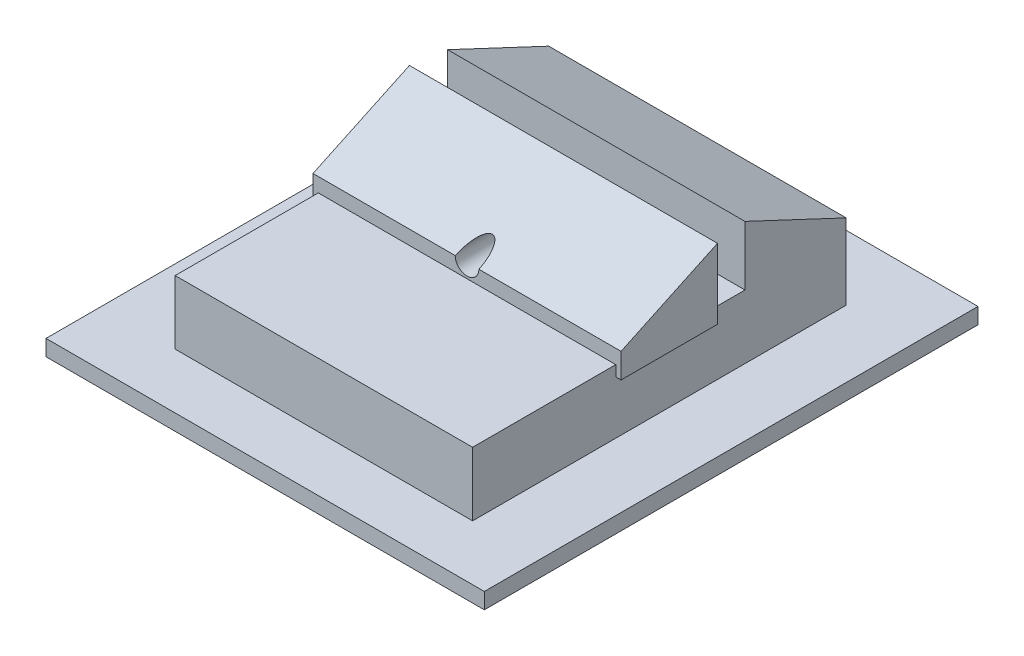
ISO-10303-21;
HEADER;
FILE_DESCRIPTION(('STEP AP214'),'2;1');
FILE_NAME('part.step','',(''),(''),'','','');
FILE_SCHEMA(('AUTOMOTIVE_DESIGN { 1 0 10303 214 1 1 1 1 }'));
ENDSEC;
DATA;
#1=APPLICATION_CONTEXT('core data for automotive mechanical design processes');
#2=APPLICATION_PROTOCOL_DEFINITION('international standard','automotive_design',2000,#1);
#3=PRODUCT_CONTEXT('',#1,'mechanical');
#4=PRODUCT('Part','Part','',(#3));
#5=PRODUCT_RELATED_PRODUCT_CATEGORY('part','',(#4));
#6=PRODUCT_DEFINITION_FORMATION('','',#4);
#7=PRODUCT_DEFINITION_CONTEXT('part definition',#1,'design');
#8=PRODUCT_DEFINITION('design','',#6,#7);
#9=PRODUCT_DEFINITION_SHAPE('','',#8);
#10=(LENGTH_UNIT() NAMED_UNIT(*) SI_UNIT(.MILLI.,.METRE.));
#11=(NAMED_UNIT(*) PLANE_ANGLE_UNIT() SI_UNIT($,.RADIAN.));
#12=(NAMED_UNIT(*) SI_UNIT($,.STERADIAN.) SOLID_ANGLE_UNIT());
#13=UNCERTAINTY_MEASURE_WITH_UNIT(LENGTH_MEASURE(1.E-05),#10,'distance_accuracy_value','');
#14=(GEOMETRIC_REPRESENTATION_CONTEXT(3) GLOBAL_UNCERTAINTY_ASSIGNED_CONTEXT((#13)) GLOBAL_UNIT_ASSIGNED_CONTEXT((#10,
#11,#12)) REPRESENTATION_CONTEXT('',''));
#15=CARTESIAN_POINT('',(0.,0.,0.));
#16=DIRECTION('',(0.,0.,1.));
#17=DIRECTION('',(1.,0.,0.));
#18=AXIS2_PLACEMENT_3D('',#15,#16,#17);
#19=CARTESIAN_POINT('',(25.,72.8506697779408,0.));
#20=DIRECTION('',(0.,1.,0.));
#21=DIRECTION('',(0.,0.,1.));
#22=AXIS2_PLACEMENT_3D('',#19,#20,#21);
#23=PLANE('',#22);
#24=DIRECTION('',(-1.,0.,0.));
#25=VECTOR('',#24,1.);
#26=CARTESIAN_POINT('',(25.,72.8506697779408,43.1120551741029));
#27=LINE('',#26,#25);
#28=CARTESIAN_POINT('',(26.5,72.8506697779408,43.1120551741029));
#29=VERTEX_POINT('',#28);
#30=CARTESIAN_POINT('',(-1.5,72.8506697779408,43.1120551741029));
#31=VERTEX_POINT('',#30);
#32=EDGE_CURVE('E59',#29,#31,#27,.T.);
#33=ORIENTED_EDGE('',*,*,#32,.T.);
#34=DIRECTION('',(0.,0.,-1.));
#35=VECTOR('',#34,1.);
#36=CARTESIAN_POINT('',(-1.5,72.8506697779408,33.5856982704937));
#37=LINE('',#36,#35);
#38=CARTESIAN_POINT('',(-1.5,72.8506697779408,46.2000152725175));
#39=VERTEX_POINT('',#38);
#40=EDGE_CURVE('E222',#39,#31,#37,.T.);
#41=ORIENTED_EDGE('',*,*,#40,.F.);
#42=DIRECTION('',(-1.,0.,0.));
#43=VECTOR('',#42,1.);
#44=CARTESIAN_POINT('',(25.,72.8506697779408,46.2000152725175));
#45=LINE('',#44,#43);
#46=CARTESIAN_POINT('',(26.5,72.8506697779408,46.2000152725175));
#47=VERTEX_POINT('',#46);
#48=EDGE_CURVE('E190',#47,#39,#45,.T.);
#49=ORIENTED_EDGE('',*,*,#48,.F.);
#50=DIRECTION('',(0.,0.,1.));
#51=VECTOR('',#50,1.);
#52=CARTESIAN_POINT('',(26.5,72.8506697779408,68.7550575810576));
#53=LINE('',#52,#51);
#54=EDGE_CURVE('E182',#29,#47,#53,.T.);
#55=ORIENTED_EDGE('',*,*,#54,.F.);
#56=EDGE_LOOP('',(#33,#41,#49,#55));
#57=FACE_BOUND('',#56,.T.);
#58=ADVANCED_FACE('F38',(#57),#23,.T.);
#59=CARTESIAN_POINT('',(-1.5,0.,0.));
#60=DIRECTION('',(1.,0.,0.));
#61=DIRECTION('',(0.,0.,-1.));
#62=AXIS2_PLACEMENT_3D('',#59,#60,#61);
#63=PLANE('',#62);
#64=DIRECTION('',(0.,1.,0.));
#65=VECTOR('',#64,1.);
#66=CARTESIAN_POINT('',(-1.5,0.,55.2786179618566));
#67=LINE('',#66,#65);
#68=CARTESIAN_POINT('',(-1.5,71.8506697779408,55.2786179618566));
#69=VERTEX_POINT('',#68);
#70=CARTESIAN_POINT('',(-1.5,72.8506697779408,55.2786179618566));
#71=VERTEX_POINT('',#70);
#72=EDGE_CURVE('E331',#69,#71,#67,.T.);
#73=ORIENTED_EDGE('',*,*,#72,.F.);
#74=DIRECTION('',(0.,0.,1.));
#75=VECTOR('',#74,1.);
#76=CARTESIAN_POINT('',(-1.5,71.8506697779408,0.));
#77=LINE('',#76,#75);
#78=CARTESIAN_POINT('',(-1.5,71.8506697779408,46.2000152725175));
#79=VERTEX_POINT('',#78);
#80=EDGE_CURVE('E333',#79,#69,#77,.T.);
#81=ORIENTED_EDGE('',*,*,#80,.F.);
#82=DIRECTION('',(0.,-1.,0.));
#83=VECTOR('',#82,1.);
#84=CARTESIAN_POINT('',(-1.5,0.,46.2000152725175));
#85=LINE('',#84,#83);
#86=EDGE_CURVE('E217',#39,#79,#85,.T.);
#87=ORIENTED_EDGE('',*,*,#86,.F.);
#88=ORIENTED_EDGE('',*,*,#40,.T.);
#89=DIRECTION('',(0.,1.,0.));
#90=VECTOR('',#89,1.);
#91=CARTESIAN_POINT('',(-1.5,72.8506697779408,43.1120551741029));
#92=LINE('',#91,#90);
#93=CARTESIAN_POINT('',(-1.5,78.4444528632995,43.1120551741029));
#94=VERTEX_POINT('',#93);
#95=EDGE_CURVE('E345',#31,#94,#92,.T.);
#96=ORIENTED_EDGE('',*,*,#95,.T.);
#97=DIRECTION('',(0.,-0.425308365150564,-0.905048503967027));
#98=VECTOR('',#97,1.);
#99=CARTESIAN_POINT('',(-1.5,78.4444528632995,43.1120551741029));
#100=LINE('',#99,#98);
#101=CARTESIAN_POINT('',(-1.5,73.9677433137499,33.5856982704937));
#102=VERTEX_POINT('',#101);
#103=EDGE_CURVE('E343',#94,#102,#100,.T.);
#104=ORIENTED_EDGE('',*,*,#103,.T.);
#105=DIRECTION('',(0.,-1.,0.));
#106=VECTOR('',#105,1.);
#107=CARTESIAN_POINT('',(-1.5,66.8506697779408,33.5856982704937));
#108=LINE('',#107,#106);
#109=CARTESIAN_POINT('',(-1.5,66.8506697779408,33.5856982704937));
#110=VERTEX_POINT('',#109);
#111=EDGE_CURVE('E267',#102,#110,#108,.T.);
#112=ORIENTED_EDGE('',*,*,#111,.T.);
#113=DIRECTION('',(0.,0.,1.));
#114=VECTOR('',#113,1.);
#115=CARTESIAN_POINT('',(-1.5,66.8506697779408,33.5856982704937));
#116=LINE('',#115,#114);
#117=CARTESIAN_POINT('',(-1.5,66.8506697779408,68.7550575810576));
#118=VERTEX_POINT('',#117);
#119=EDGE_CURVE('E232',#110,#118,#116,.T.);
#120=ORIENTED_EDGE('',*,*,#119,.T.);
#121=DIRECTION('',(0.,1.,0.));
#122=VECTOR('',#121,1.);
#123=CARTESIAN_POINT('',(-1.5,66.8506697779408,68.7550575810576));
#124=LINE('',#123,#122);
#125=CARTESIAN_POINT('',(-1.5,72.8506697779408,68.7550575810576));
#126=VERTEX_POINT('',#125);
#127=EDGE_CURVE('E227',#118,#126,#124,.T.);
#128=ORIENTED_EDGE('',*,*,#127,.T.);
#129=EDGE_CURVE('E226',#126,#71,#37,.T.);
#130=ORIENTED_EDGE('',*,*,#129,.T.);
#131=EDGE_LOOP('',(#73,#81,#87,#88,#96,#104,#112,#120,#128,#130));
#132=FACE_BOUND('',#131,.T.);
#133=ADVANCED_FACE('F265',(#132),#63,.F.);
#134=CARTESIAN_POINT('',(26.5,0.,0.));
#135=DIRECTION('',(1.,0.,0.));
#136=DIRECTION('',(0.,0.,-1.));
#137=AXIS2_PLACEMENT_3D('',#134,#135,#136);
#138=PLANE('',#137);
#139=DIRECTION('',(0.,0.,-1.));
#140=VECTOR('',#139,1.);
#141=CARTESIAN_POINT('',(26.5,71.8506697779408,55.2786179618566));
#142=LINE('',#141,#140);
#143=CARTESIAN_POINT('',(26.5,71.8506697779408,55.2786179618566));
#144=VERTEX_POINT('',#143);
#145=CARTESIAN_POINT('',(26.5,71.8506697779408,46.2000152725175));
#146=VERTEX_POINT('',#145);
#147=EDGE_CURVE('E320',#144,#146,#142,.T.);
#148=ORIENTED_EDGE('',*,*,#147,.F.);
#149=DIRECTION('',(0.,-1.,0.));
#150=VECTOR('',#149,1.);
#151=CARTESIAN_POINT('',(26.5,72.8506697779408,55.2786179618566));
#152=LINE('',#151,#150);
#153=CARTESIAN_POINT('',(26.5,72.8506697779408,55.2786179618566));
#154=VERTEX_POINT('',#153);
#155=EDGE_CURVE('E250',#154,#144,#152,.T.);
#156=ORIENTED_EDGE('',*,*,#155,.F.);
#157=CARTESIAN_POINT('',(26.5,72.8506697779408,68.7550575810576));
#158=VERTEX_POINT('',#157);
#159=EDGE_CURVE('E185',#154,#158,#53,.T.);
#160=ORIENTED_EDGE('',*,*,#159,.T.);
#161=DIRECTION('',(0.,-1.,0.));
#162=VECTOR('',#161,1.);
#163=CARTESIAN_POINT('',(26.5,72.8506697779408,68.7550575810576));
#164=LINE('',#163,#162);
#165=CARTESIAN_POINT('',(26.5,66.8506697779408,68.7550575810576));
#166=VERTEX_POINT('',#165);
#167=EDGE_CURVE('E230',#158,#166,#164,.T.);
#168=ORIENTED_EDGE('',*,*,#167,.T.);
#169=DIRECTION('',(0.,0.,-1.));
#170=VECTOR('',#169,1.);
#171=CARTESIAN_POINT('',(26.5,66.8506697779408,68.7550575810576));
#172=LINE('',#171,#170);
#173=CARTESIAN_POINT('',(26.5,66.8506697779408,33.5856982704937));
#174=VERTEX_POINT('',#173);
#175=EDGE_CURVE('E238',#166,#174,#172,.T.);
#176=ORIENTED_EDGE('',*,*,#175,.T.);
#177=DIRECTION('',(0.,1.,0.));
#178=VECTOR('',#177,1.);
#179=CARTESIAN_POINT('',(26.5,72.8506697779408,33.5856982704937));
#180=LINE('',#179,#178);
#181=CARTESIAN_POINT('',(26.5,73.9677433137499,33.5856982704937));
#182=VERTEX_POINT('',#181);
#183=EDGE_CURVE('E240',#174,#182,#180,.T.);
#184=ORIENTED_EDGE('',*,*,#183,.T.);
#185=DIRECTION('',(0.,0.425308365150564,0.905048503967027));
#186=VECTOR('',#185,1.);
#187=CARTESIAN_POINT('',(26.5,73.9677433137499,33.5856982704937));
#188=LINE('',#187,#186);
#189=CARTESIAN_POINT('',(26.5,78.4444528632995,43.1120551741029));
#190=VERTEX_POINT('',#189);
#191=EDGE_CURVE('E336',#182,#190,#188,.T.);
#192=ORIENTED_EDGE('',*,*,#191,.T.);
#193=DIRECTION('',(0.,-1.,0.));
#194=VECTOR('',#193,1.);
#195=CARTESIAN_POINT('',(26.5,78.4444528632995,43.1120551741029));
#196=LINE('',#195,#194);
#197=EDGE_CURVE('E340',#190,#29,#196,.T.);
#198=ORIENTED_EDGE('',*,*,#197,.T.);
#199=ORIENTED_EDGE('',*,*,#54,.T.);
#200=DIRECTION('',(0.,1.,0.));
#201=VECTOR('',#200,1.);
#202=CARTESIAN_POINT('',(26.5,71.8506697779408,46.2000152725175));
#203=LINE('',#202,#201);
#204=EDGE_CURVE('E221',#146,#47,#203,.T.);
#205=ORIENTED_EDGE('',*,*,#204,.F.);
#206=EDGE_LOOP('',(#148,#156,#160,#168,#176,#184,#192,#198,#199,#205));
#207=FACE_BOUND('',#206,.T.);
#208=ADVANCED_FACE('F248',(#207),#138,.T.);
#209=DIRECTION('',(-1.,0.,0.));
#210=VECTOR('',#209,1.);
#211=CARTESIAN_POINT('',(25.,72.8506697779408,55.2786179618566));
#212=LINE('',#211,#210);
#213=EDGE_CURVE('E46',#154,#71,#212,.T.);
#214=ORIENTED_EDGE('',*,*,#213,.T.);
#215=ORIENTED_EDGE('',*,*,#129,.F.);
#216=DIRECTION('',(-1.,0.,0.));
#217=VECTOR('',#216,1.);
#218=CARTESIAN_POINT('',(25.,72.8506697779408,68.7550575810576));
#219=LINE('',#218,#217);
#220=EDGE_CURVE('E201',#158,#126,#219,.T.);
#221=ORIENTED_EDGE('',*,*,#220,.F.);
#222=ORIENTED_EDGE('',*,*,#159,.F.);
#223=EDGE_LOOP('',(#214,#215,#221,#222));
#224=FACE_BOUND('',#223,.T.);
#225=ADVANCED_FACE('F254',(#224),#23,.T.);
#226=CARTESIAN_POINT('',(25.,0.,55.2786179618566));
#227=DIRECTION('',(0.,0.,1.));
#228=DIRECTION('',(1.,0.,0.));
#229=AXIS2_PLACEMENT_3D('',#226,#227,#228);
#230=PLANE('',#229);
#231=CARTESIAN_POINT('',(12.5,74.1848405548437,55.2786179618566));
#232=DIRECTION('',(0.,0.,1.));
#233=DIRECTION('',(1.,0.,0.));
#234=AXIS2_PLACEMENT_3D('',#231,#232,#233);
#235=CIRCLE('',#234,1.11444040134291);
#236=CARTESIAN_POINT('',(11.3855595986571,74.1848405548437,55.2786179618566));
#237=VERTEX_POINT('',#236);
#238=CARTESIAN_POINT('',(13.6144404013429,74.1848405548437,55.2786179618566));
#239=VERTEX_POINT('',#238);
#240=EDGE_CURVE('E52',#237,#239,#235,.T.);
#241=ORIENTED_EDGE('',*,*,#240,.F.);
#242=DIRECTION('',(-1.,0.,0.));
#243=VECTOR('',#242,1.);
#244=CARTESIAN_POINT('',(25.,74.1848405548437,55.2786179618566));
#245=LINE('',#244,#243);
#246=CARTESIAN_POINT('',(-2.,74.1848405548437,55.2786179618566));
#247=VERTEX_POINT('',#246);
#248=EDGE_CURVE('E172',#237,#247,#245,.T.);
#249=ORIENTED_EDGE('',*,*,#248,.T.);
#250=DIRECTION('',(0.,1.,0.));
#251=VECTOR('',#250,1.);
#252=CARTESIAN_POINT('',(-2.,72.8506697779408,55.2786179618566));
#253=LINE('',#252,#251);
#254=CARTESIAN_POINT('',(-2.,71.8506697779408,55.2786179618566));
#255=VERTEX_POINT('',#254);
#256=EDGE_CURVE('E309',#255,#247,#253,.T.);
#257=ORIENTED_EDGE('',*,*,#256,.F.);
#258=DIRECTION('',(1.,0.,0.));
#259=VECTOR('',#258,1.);
#260=CARTESIAN_POINT('',(-2.,71.8506697779408,55.2786179618566));
#261=LINE('',#260,#259);
#262=EDGE_CURVE('E323',#255,#69,#261,.T.);
#263=ORIENTED_EDGE('',*,*,#262,.T.);
#264=ORIENTED_EDGE('',*,*,#72,.T.);
#265=ORIENTED_EDGE('',*,*,#213,.F.);
#266=ORIENTED_EDGE('',*,*,#155,.T.);
#267=DIRECTION('',(-1.,0.,0.));
#268=VECTOR('',#267,1.);
#269=CARTESIAN_POINT('',(27.,71.8506697779408,55.2786179618566));
#270=LINE('',#269,#268);
#271=CARTESIAN_POINT('',(27.,71.8506697779408,55.2786179618566));
#272=VERTEX_POINT('',#271);
#273=EDGE_CURVE('E313',#272,#144,#270,.T.);
#274=ORIENTED_EDGE('',*,*,#273,.F.);
#275=DIRECTION('',(0.,-1.,0.));
#276=VECTOR('',#275,1.);
#277=CARTESIAN_POINT('',(27.,72.8506697779408,55.2786179618566));
#278=LINE('',#277,#276);
#279=CARTESIAN_POINT('',(27.,74.1848405548437,55.2786179618566));
#280=VERTEX_POINT('',#279);
#281=EDGE_CURVE('E293',#280,#272,#278,.T.);
#282=ORIENTED_EDGE('',*,*,#281,.F.);
#283=EDGE_CURVE('E175',#280,#239,#245,.T.);
#284=ORIENTED_EDGE('',*,*,#283,.T.);
#285=EDGE_LOOP('',(#241,#249,#257,#263,#264,#265,#266,#274,#282,#284));
#286=FACE_BOUND('',#285,.T.);
#287=ADVANCED_FACE('F40',(#286),#230,.T.);
#288=CARTESIAN_POINT('',(25.,0.,68.7550575810576));
#289=DIRECTION('',(0.,0.,-1.));
#290=DIRECTION('',(-1.,0.,0.));
#291=AXIS2_PLACEMENT_3D('',#288,#289,#290);
#292=PLANE('',#291);
#293=ORIENTED_EDGE('',*,*,#220,.T.);
#294=ORIENTED_EDGE('',*,*,#127,.F.);
#295=DIRECTION('',(-1.,0.,0.));
#296=VECTOR('',#295,1.);
#297=CARTESIAN_POINT('',(25.,66.8506697779408,68.7550575810576));
#298=LINE('',#297,#296);
#299=EDGE_CURVE('E199',#166,#118,#298,.T.);
#300=ORIENTED_EDGE('',*,*,#299,.F.);
#301=ORIENTED_EDGE('',*,*,#167,.F.);
#302=EDGE_LOOP('',(#293,#294,#300,#301));
#303=FACE_BOUND('',#302,.T.);
#304=ADVANCED_FACE('F258',(#303),#292,.F.);
#305=CARTESIAN_POINT('',(25.,0.,33.5856982704937));
#306=DIRECTION('',(0.,0.,-1.));
#307=DIRECTION('',(-1.,0.,0.));
#308=AXIS2_PLACEMENT_3D('',#305,#306,#307);
#309=PLANE('',#308);
#310=ORIENTED_EDGE('',*,*,#111,.F.);
#311=DIRECTION('',(-1.,0.,0.));
#312=VECTOR('',#311,1.);
#313=CARTESIAN_POINT('',(25.,73.9677433137499,33.5856982704937));
#314=LINE('',#313,#312);
#315=EDGE_CURVE('E193',#182,#102,#314,.T.);
#316=ORIENTED_EDGE('',*,*,#315,.F.);
#317=ORIENTED_EDGE('',*,*,#183,.F.);
#318=DIRECTION('',(-1.,0.,0.));
#319=VECTOR('',#318,1.);
#320=CARTESIAN_POINT('',(25.,66.8506697779408,33.5856982704937));
#321=LINE('',#320,#319);
#322=EDGE_CURVE('E196',#174,#110,#321,.T.);
#323=ORIENTED_EDGE('',*,*,#322,.T.);
#324=EDGE_LOOP('',(#310,#316,#317,#323));
#325=FACE_BOUND('',#324,.T.);
#326=ADVANCED_FACE('F389',(#325),#309,.T.);
#327=CARTESIAN_POINT('',(25.,47.6599601132555,-22.3967882716353));
#328=DIRECTION('',(0.,0.905048503967027,-0.425308365150564));
#329=DIRECTION('',(0.,0.425308365150565,0.905048503967027));
#330=AXIS2_PLACEMENT_3D('',#327,#328,#329);
#331=PLANE('',#330);
#332=ORIENTED_EDGE('',*,*,#315,.T.);
#333=ORIENTED_EDGE('',*,*,#103,.F.);
#334=DIRECTION('',(-1.,0.,0.));
#335=VECTOR('',#334,1.);
#336=CARTESIAN_POINT('',(25.,78.4444528632995,43.1120551741029));
#337=LINE('',#336,#335);
#338=EDGE_CURVE('E191',#190,#94,#337,.T.);
#339=ORIENTED_EDGE('',*,*,#338,.F.);
#340=ORIENTED_EDGE('',*,*,#191,.F.);
#341=EDGE_LOOP('',(#332,#333,#339,#340));
#342=FACE_BOUND('',#341,.T.);
#343=ADVANCED_FACE('F384',(#342),#331,.T.);
#344=CARTESIAN_POINT('',(25.,0.,43.1120551741029));
#345=DIRECTION('',(0.,0.,1.));
#346=DIRECTION('',(1.,0.,0.));
#347=AXIS2_PLACEMENT_3D('',#344,#345,#346);
#348=PLANE('',#347);
#349=ORIENTED_EDGE('',*,*,#338,.T.);
#350=ORIENTED_EDGE('',*,*,#95,.F.);
#351=ORIENTED_EDGE('',*,*,#32,.F.);
#352=ORIENTED_EDGE('',*,*,#197,.F.);
#353=EDGE_LOOP('',(#349,#350,#351,#352));
#354=FACE_BOUND('',#353,.T.);
#355=ADVANCED_FACE('F380',(#354),#348,.T.);
#356=CARTESIAN_POINT('',(25.,0.,46.2000152725175));
#357=DIRECTION('',(0.,0.,1.));
#358=DIRECTION('',(1.,0.,0.));
#359=AXIS2_PLACEMENT_3D('',#356,#357,#358);
#360=PLANE('',#359);
#361=CARTESIAN_POINT('',(12.5,74.1848405548437,46.2000152725175));
#362=DIRECTION('',(0.,0.,1.));
#363=DIRECTION('',(1.,0.,0.));
#364=AXIS2_PLACEMENT_3D('',#361,#362,#363);
#365=CIRCLE('',#364,1.11444040134291);
#366=CARTESIAN_POINT('',(13.6144404013429,74.1848405548437,46.2000152725175));
#367=VERTEX_POINT('',#366);
#368=EDGE_CURVE('E176',#367,#367,#365,.T.);
#369=ORIENTED_EDGE('',*,*,#368,.T.);
#370=EDGE_LOOP('',(#369));
#371=FACE_BOUND('',#370,.T.);
#372=ORIENTED_EDGE('',*,*,#48,.T.);
#373=ORIENTED_EDGE('',*,*,#86,.T.);
#374=DIRECTION('',(1.,0.,0.));
#375=VECTOR('',#374,1.);
#376=CARTESIAN_POINT('',(-2.,71.8506697779408,46.2000152725175));
#377=LINE('',#376,#375);
#378=CARTESIAN_POINT('',(-2.,71.8506697779408,46.2000152725175));
#379=VERTEX_POINT('',#378);
#380=EDGE_CURVE('E327',#379,#79,#377,.T.);
#381=ORIENTED_EDGE('',*,*,#380,.F.);
#382=DIRECTION('',(0.,-1.,0.));
#383=VECTOR('',#382,1.);
#384=CARTESIAN_POINT('',(-2.,78.4511374999575,46.2000152725175));
#385=LINE('',#384,#383);
#386=CARTESIAN_POINT('',(-2.,78.4511374999575,46.2000152725175));
#387=VERTEX_POINT('',#386);
#388=EDGE_CURVE('E311',#387,#379,#385,.T.);
#389=ORIENTED_EDGE('',*,*,#388,.F.);
#390=DIRECTION('',(-1.,0.,0.));
#391=VECTOR('',#390,1.);
#392=CARTESIAN_POINT('',(25.,78.4511374999575,46.2000152725175));
#393=LINE('',#392,#391);
#394=CARTESIAN_POINT('',(27.,78.4511374999575,46.2000152725175));
#395=VERTEX_POINT('',#394);
#396=EDGE_CURVE('E184',#395,#387,#393,.T.);
#397=ORIENTED_EDGE('',*,*,#396,.F.);
#398=DIRECTION('',(0.,1.,0.));
#399=VECTOR('',#398,1.);
#400=CARTESIAN_POINT('',(27.,78.4511374999575,46.2000152725175));
#401=LINE('',#400,#399);
#402=CARTESIAN_POINT('',(27.,71.8506697779408,46.2000152725175));
#403=VERTEX_POINT('',#402);
#404=EDGE_CURVE('E305',#403,#395,#401,.T.);
#405=ORIENTED_EDGE('',*,*,#404,.F.);
#406=DIRECTION('',(-1.,0.,0.));
#407=VECTOR('',#406,1.);
#408=CARTESIAN_POINT('',(27.,71.8506697779408,46.2000152725175));
#409=LINE('',#408,#407);
#410=EDGE_CURVE('E316',#403,#146,#409,.T.);
#411=ORIENTED_EDGE('',*,*,#410,.T.);
#412=ORIENTED_EDGE('',*,*,#204,.T.);
#413=EDGE_LOOP('',(#372,#373,#381,#389,#397,#405,#411,#412));
#414=FACE_BOUND('',#413,.T.);
#415=ADVANCED_FACE('F215',(#371,#414),#360,.F.);
#416=CARTESIAN_POINT('',(25.,82.0438574723616,38.5547721909579));
#417=DIRECTION('',(0.,-0.905048503967027,-0.425308365150564));
#418=DIRECTION('',(0.,0.425308365150565,-0.905048503967027));
#419=AXIS2_PLACEMENT_3D('',#416,#417,#418);
#420=PLANE('',#419);
#421=ORIENTED_EDGE('',*,*,#248,.F.);
#422=CARTESIAN_POINT('',(12.5,74.1848405548437,55.2786179618566));
#423=DIRECTION('',(0.,-0.905048503967027,-0.425308365150564));
#424=DIRECTION('',(0.,-0.425308365150564,0.905048503967027));
#425=AXIS2_PLACEMENT_3D('',#422,#423,#424);
#426=ELLIPSE('',#425,2.62031150256917,1.11444040134291);
#427=EDGE_CURVE('E11',#237,#239,#426,.T.);
#428=ORIENTED_EDGE('',*,*,#427,.T.);
#429=ORIENTED_EDGE('',*,*,#283,.F.);
#430=DIRECTION('',(0.,-0.425308365150563,0.905048503967028));
#431=VECTOR('',#430,1.);
#432=CARTESIAN_POINT('',(27.,74.1848405548437,55.2786179618566));
#433=LINE('',#432,#431);
#434=EDGE_CURVE('E302',#395,#280,#433,.T.);
#435=ORIENTED_EDGE('',*,*,#434,.F.);
#436=ORIENTED_EDGE('',*,*,#396,.T.);
#437=DIRECTION('',(0.,0.425308365150563,-0.905048503967028));
#438=VECTOR('',#437,1.);
#439=CARTESIAN_POINT('',(-2.,74.1848405548437,55.2786179618566));
#440=LINE('',#439,#438);
#441=EDGE_CURVE('E181',#247,#387,#440,.T.);
#442=ORIENTED_EDGE('',*,*,#441,.F.);
#443=EDGE_LOOP('',(#421,#428,#429,#435,#436,#442));
#444=FACE_BOUND('',#443,.T.);
#445=ADVANCED_FACE('F179',(#444),#420,.F.);
#446=CARTESIAN_POINT('',(-8.45650709040854,65.3506697779408,73.9567160795278));
#447=DIRECTION('',(1.,0.,0.));
#448=DIRECTION('',(0.,0.,-1.));
#449=AXIS2_PLACEMENT_3D('',#446,#447,#448);
#450=PLANE('',#449);
#451=DIRECTION('',(0.,0.,-1.));
#452=VECTOR('',#451,1.);
#453=CARTESIAN_POINT('',(-8.45650709040854,66.8506697779408,73.9567160795278));
#454=LINE('',#453,#452);
#455=CARTESIAN_POINT('',(-8.45650709040854,66.8506697779408,73.9567160795278));
#456=VERTEX_POINT('',#455);
#457=CARTESIAN_POINT('',(-8.45650709040854,66.8506697779408,27.4835577366269));
#458=VERTEX_POINT('',#457);
#459=EDGE_CURVE('E290',#456,#458,#454,.T.);
#460=ORIENTED_EDGE('',*,*,#459,.T.);
#461=DIRECTION('',(0.,1.,0.));
#462=VECTOR('',#461,1.);
#463=CARTESIAN_POINT('',(-8.45650709040854,65.3506697779408,27.4835577366269));
#464=LINE('',#463,#462);
#465=CARTESIAN_POINT('',(-8.45650709040854,65.3506697779408,27.4835577366269));
#466=VERTEX_POINT('',#465);
#467=EDGE_CURVE('E268',#466,#458,#464,.T.);
#468=ORIENTED_EDGE('',*,*,#467,.F.);
#469=DIRECTION('',(0.,0.,-1.));
#470=VECTOR('',#469,1.);
#471=CARTESIAN_POINT('',(-8.45650709040854,65.3506697779408,73.9567160795278));
#472=LINE('',#471,#470);
#473=CARTESIAN_POINT('',(-8.45650709040854,65.3506697779408,73.9567160795278));
#474=VERTEX_POINT('',#473);
#475=EDGE_CURVE('E285',#474,#466,#472,.T.);
#476=ORIENTED_EDGE('',*,*,#475,.F.);
#477=DIRECTION('',(0.,1.,0.));
#478=VECTOR('',#477,1.);
#479=CARTESIAN_POINT('',(-8.45650709040854,65.3506697779408,73.9567160795278));
#480=LINE('',#479,#478);
#481=EDGE_CURVE('E279',#474,#456,#480,.T.);
#482=ORIENTED_EDGE('',*,*,#481,.T.);
#483=EDGE_LOOP('',(#460,#468,#476,#482));
#484=FACE_BOUND('',#483,.T.);
#485=ADVANCED_FACE('F378',(#484),#450,.F.);
#486=CARTESIAN_POINT('',(-8.45650709040854,65.3506697779408,27.4835577366269));
#487=DIRECTION('',(0.,0.,1.));
#488=DIRECTION('',(1.,0.,0.));
#489=AXIS2_PLACEMENT_3D('',#486,#487,#488);
#490=PLANE('',#489);
#491=DIRECTION('',(1.,0.,0.));
#492=VECTOR('',#491,1.);
#493=CARTESIAN_POINT('',(-8.45650709040854,66.8506697779408,27.4835577366269));
#494=LINE('',#493,#492);
#495=CARTESIAN_POINT('',(32.8060244079853,66.8506697779408,27.4835577366269));
#496=VERTEX_POINT('',#495);
#497=EDGE_CURVE('E288',#458,#496,#494,.T.);
#498=ORIENTED_EDGE('',*,*,#497,.T.);
#499=DIRECTION('',(0.,1.,0.));
#500=VECTOR('',#499,1.);
#501=CARTESIAN_POINT('',(32.8060244079853,65.3506697779408,27.4835577366269));
#502=LINE('',#501,#500);
#503=CARTESIAN_POINT('',(32.8060244079853,65.3506697779408,27.4835577366269));
#504=VERTEX_POINT('',#503);
#505=EDGE_CURVE('E273',#504,#496,#502,.T.);
#506=ORIENTED_EDGE('',*,*,#505,.F.);
#507=DIRECTION('',(1.,0.,0.));
#508=VECTOR('',#507,1.);
#509=CARTESIAN_POINT('',(-8.45650709040854,65.3506697779408,27.4835577366269));
#510=LINE('',#509,#508);
#511=EDGE_CURVE('E297',#466,#504,#510,.T.);
#512=ORIENTED_EDGE('',*,*,#511,.F.);
#513=ORIENTED_EDGE('',*,*,#467,.T.);
#514=EDGE_LOOP('',(#498,#506,#512,#513));
#515=FACE_BOUND('',#514,.T.);
#516=ADVANCED_FACE('F448',(#515),#490,.F.);
#517=CARTESIAN_POINT('',(32.8060244079853,65.3506697779408,73.9567160795278));
#518=DIRECTION('',(-1.,0.,0.));
#519=DIRECTION('',(0.,0.,1.));
#520=AXIS2_PLACEMENT_3D('',#517,#518,#519);
#521=PLANE('',#520);
#522=DIRECTION('',(0.,0.,1.));
#523=VECTOR('',#522,1.);
#524=CARTESIAN_POINT('',(32.8060244079853,66.8506697779408,73.9567160795278));
#525=LINE('',#524,#523);
#526=CARTESIAN_POINT('',(32.8060244079853,66.8506697779408,73.9567160795278));
#527=VERTEX_POINT('',#526);
#528=EDGE_CURVE('E286',#496,#527,#525,.T.);
#529=ORIENTED_EDGE('',*,*,#528,.T.);
#530=DIRECTION('',(0.,1.,0.));
#531=VECTOR('',#530,1.);
#532=CARTESIAN_POINT('',(32.8060244079853,65.3506697779408,73.9567160795278));
#533=LINE('',#532,#531);
#534=CARTESIAN_POINT('',(32.8060244079853,65.3506697779408,73.9567160795278));
#535=VERTEX_POINT('',#534);
#536=EDGE_CURVE('E276',#535,#527,#533,.T.);
#537=ORIENTED_EDGE('',*,*,#536,.F.);
#538=DIRECTION('',(0.,0.,1.));
#539=VECTOR('',#538,1.);
#540=CARTESIAN_POINT('',(32.8060244079853,65.3506697779408,73.9567160795278));
#541=LINE('',#540,#539);
#542=EDGE_CURVE('E295',#504,#535,#541,.T.);
#543=ORIENTED_EDGE('',*,*,#542,.F.);
#544=ORIENTED_EDGE('',*,*,#505,.T.);
#545=EDGE_LOOP('',(#529,#537,#543,#544));
#546=FACE_BOUND('',#545,.T.);
#547=ADVANCED_FACE('F455',(#546),#521,.F.);
#548=CARTESIAN_POINT('',(-8.45650709040854,65.3506697779408,73.9567160795278));
#549=DIRECTION('',(0.,0.,-1.));
#550=DIRECTION('',(-1.,0.,0.));
#551=AXIS2_PLACEMENT_3D('',#548,#549,#550);
#552=PLANE('',#551);
#553=DIRECTION('',(-1.,0.,0.));
#554=VECTOR('',#553,1.);
#555=CARTESIAN_POINT('',(-8.45650709040854,66.8506697779408,73.9567160795278));
#556=LINE('',#555,#554);
#557=EDGE_CURVE('E283',#527,#456,#556,.T.);
#558=ORIENTED_EDGE('',*,*,#557,.T.);
#559=ORIENTED_EDGE('',*,*,#481,.F.);
#560=DIRECTION('',(-1.,0.,0.));
#561=VECTOR('',#560,1.);
#562=CARTESIAN_POINT('',(-8.45650709040854,65.3506697779408,73.9567160795278));
#563=LINE('',#562,#561);
#564=EDGE_CURVE('E282',#535,#474,#563,.T.);
#565=ORIENTED_EDGE('',*,*,#564,.F.);
#566=ORIENTED_EDGE('',*,*,#536,.T.);
#567=EDGE_LOOP('',(#558,#559,#565,#566));
#568=FACE_BOUND('',#567,.T.);
#569=ADVANCED_FACE('F463',(#568),#552,.F.);
#570=CARTESIAN_POINT('',(0.,65.3506697779408,0.));
#571=DIRECTION('',(0.,-1.,0.));
#572=DIRECTION('',(0.,0.,-1.));
#573=AXIS2_PLACEMENT_3D('',#570,#571,#572);
#574=PLANE('',#573);
#575=ORIENTED_EDGE('',*,*,#475,.T.);
#576=ORIENTED_EDGE('',*,*,#511,.T.);
#577=ORIENTED_EDGE('',*,*,#542,.T.);
#578=ORIENTED_EDGE('',*,*,#564,.T.);
#579=EDGE_LOOP('',(#575,#576,#577,#578));
#580=FACE_BOUND('',#579,.T.);
#581=ADVANCED_FACE('F471',(#580),#574,.T.);
#582=CARTESIAN_POINT('',(0.,66.8506697779408,0.));
#583=DIRECTION('',(0.,-1.,0.));
#584=DIRECTION('',(0.,0.,-1.));
#585=AXIS2_PLACEMENT_3D('',#582,#583,#584);
#586=PLANE('',#585);
#587=ORIENTED_EDGE('',*,*,#175,.F.);
#588=ORIENTED_EDGE('',*,*,#299,.T.);
#589=ORIENTED_EDGE('',*,*,#119,.F.);
#590=ORIENTED_EDGE('',*,*,#322,.F.);
#591=EDGE_LOOP('',(#587,#588,#589,#590));
#592=FACE_BOUND('',#591,.T.);
#593=ORIENTED_EDGE('',*,*,#459,.F.);
#594=ORIENTED_EDGE('',*,*,#557,.F.);
#595=ORIENTED_EDGE('',*,*,#528,.F.);
#596=ORIENTED_EDGE('',*,*,#497,.F.);
#597=EDGE_LOOP('',(#593,#594,#595,#596));
#598=FACE_BOUND('',#597,.T.);
#599=ADVANCED_FACE('F261',(#592,#598),#586,.F.);
#600=CARTESIAN_POINT('',(27.,0.,0.));
#601=DIRECTION('',(-1.,0.,0.));
#602=DIRECTION('',(0.,0.,1.));
#603=AXIS2_PLACEMENT_3D('',#600,#601,#602);
#604=PLANE('',#603);
#605=ORIENTED_EDGE('',*,*,#281,.T.);
#606=DIRECTION('',(0.,0.,-1.));
#607=VECTOR('',#606,1.);
#608=CARTESIAN_POINT('',(27.,71.8506697779408,55.2786179618566));
#609=LINE('',#608,#607);
#610=EDGE_CURVE('E318',#272,#403,#609,.T.);
#611=ORIENTED_EDGE('',*,*,#610,.T.);
#612=ORIENTED_EDGE('',*,*,#404,.T.);
#613=ORIENTED_EDGE('',*,*,#434,.T.);
#614=EDGE_LOOP('',(#605,#611,#612,#613));
#615=FACE_BOUND('',#614,.T.);
#616=ADVANCED_FACE('F486',(#615),#604,.F.);
#617=CARTESIAN_POINT('',(-2.,0.,0.));
#618=DIRECTION('',(-1.,0.,0.));
#619=DIRECTION('',(0.,0.,1.));
#620=AXIS2_PLACEMENT_3D('',#617,#618,#619);
#621=PLANE('',#620);
#622=ORIENTED_EDGE('',*,*,#388,.T.);
#623=DIRECTION('',(0.,0.,1.));
#624=VECTOR('',#623,1.);
#625=CARTESIAN_POINT('',(-2.,71.8506697779408,0.));
#626=LINE('',#625,#624);
#627=EDGE_CURVE('E329',#379,#255,#626,.T.);
#628=ORIENTED_EDGE('',*,*,#627,.T.);
#629=ORIENTED_EDGE('',*,*,#256,.T.);
#630=ORIENTED_EDGE('',*,*,#441,.T.);
#631=EDGE_LOOP('',(#622,#628,#629,#630));
#632=FACE_BOUND('',#631,.T.);
#633=ADVANCED_FACE('F493',(#632),#621,.T.);
#634=CARTESIAN_POINT('',(27.,71.8506697779408,55.2786179618566));
#635=DIRECTION('',(0.,1.,0.));
#636=DIRECTION('',(0.,0.,1.));
#637=AXIS2_PLACEMENT_3D('',#634,#635,#636);
#638=PLANE('',#637);
#639=ORIENTED_EDGE('',*,*,#147,.T.);
#640=ORIENTED_EDGE('',*,*,#410,.F.);
#641=ORIENTED_EDGE('',*,*,#610,.F.);
#642=ORIENTED_EDGE('',*,*,#273,.T.);
#643=EDGE_LOOP('',(#639,#640,#641,#642));
#644=FACE_BOUND('',#643,.T.);
#645=ADVANCED_FACE('F356',(#644),#638,.F.);
#646=CARTESIAN_POINT('',(-2.,71.8506697779408,0.));
#647=DIRECTION('',(0.,1.,0.));
#648=DIRECTION('',(0.,0.,1.));
#649=AXIS2_PLACEMENT_3D('',#646,#647,#648);
#650=PLANE('',#649);
#651=ORIENTED_EDGE('',*,*,#80,.T.);
#652=ORIENTED_EDGE('',*,*,#262,.F.);
#653=ORIENTED_EDGE('',*,*,#627,.F.);
#654=ORIENTED_EDGE('',*,*,#380,.T.);
#655=EDGE_LOOP('',(#651,#652,#653,#654));
#656=FACE_BOUND('',#655,.T.);
#657=ADVANCED_FACE('F351',(#656),#650,.F.);
#658=CARTESIAN_POINT('',(12.5,74.1848405548437,45.2786179618566));
#659=DIRECTION('',(0.,0.,1.));
#660=DIRECTION('',(1.,0.,0.));
#661=AXIS2_PLACEMENT_3D('',#658,#659,#660);
#662=CYLINDRICAL_SURFACE('',#661,1.11444040134291);
#663=ORIENTED_EDGE('',*,*,#240,.T.);
#664=ORIENTED_EDGE('',*,*,#427,.F.);
#665=EDGE_LOOP('',(#663,#664));
#666=FACE_BOUND('',#665,.T.);
#667=ORIENTED_EDGE('',*,*,#368,.F.);
#668=EDGE_LOOP('',(#667));
#669=FACE_BOUND('',#668,.T.);
#670=ADVANCED_FACE('F166',(#666,#669),#662,.F.);
#671=CLOSED_SHELL('',(#58,#133,#208,#225,#287,#304,#326,#343,#355,#415,#445,#485,#516,#547,#569,
#581,#599,#616,#633,#645,#657,#670));
#672=MANIFOLD_SOLID_BREP('B2',#671);
#673=ADVANCED_BREP_SHAPE_REPRESENTATION('',(#18,#672),#14);
#674=SHAPE_DEFINITION_REPRESENTATION(#9,#673);
ENDSEC;
END-ISO-10303-21;
